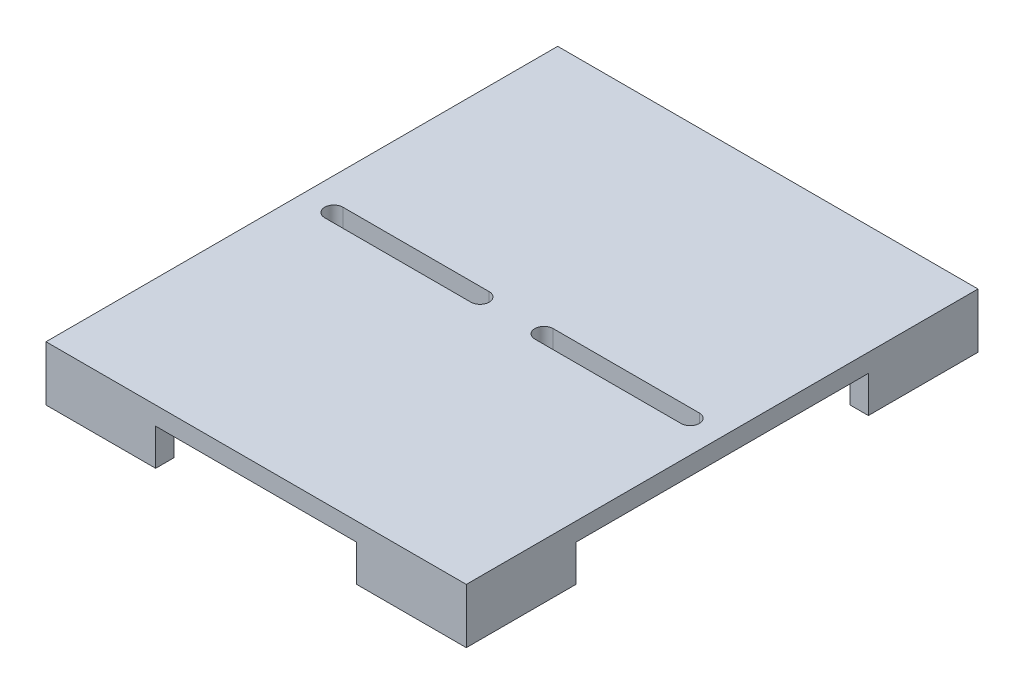
ISO-10303-21;
HEADER;
FILE_DESCRIPTION(('STEP AP214'),'2;1');
FILE_NAME('part.step','',(''),(''),'','','');
FILE_SCHEMA(('AUTOMOTIVE_DESIGN { 1 0 10303 214 1 1 1 1 }'));
ENDSEC;
DATA;
#1=APPLICATION_CONTEXT('core data for automotive mechanical design processes');
#2=APPLICATION_PROTOCOL_DEFINITION('international standard','automotive_design',2000,#1);
#3=PRODUCT_CONTEXT('',#1,'mechanical');
#4=PRODUCT('Part','Part','',(#3));
#5=PRODUCT_RELATED_PRODUCT_CATEGORY('part','',(#4));
#6=PRODUCT_DEFINITION_FORMATION('','',#4);
#7=PRODUCT_DEFINITION_CONTEXT('part definition',#1,'design');
#8=PRODUCT_DEFINITION('design','',#6,#7);
#9=PRODUCT_DEFINITION_SHAPE('','',#8);
#10=(LENGTH_UNIT() NAMED_UNIT(*) SI_UNIT(.MILLI.,.METRE.));
#11=(NAMED_UNIT(*) PLANE_ANGLE_UNIT() SI_UNIT($,.RADIAN.));
#12=(NAMED_UNIT(*) SI_UNIT($,.STERADIAN.) SOLID_ANGLE_UNIT());
#13=UNCERTAINTY_MEASURE_WITH_UNIT(LENGTH_MEASURE(1.E-05),#10,'distance_accuracy_value','');
#14=(GEOMETRIC_REPRESENTATION_CONTEXT(3) GLOBAL_UNCERTAINTY_ASSIGNED_CONTEXT((#13)) GLOBAL_UNIT_ASSIGNED_CONTEXT((#10,
#11,#12)) REPRESENTATION_CONTEXT('',''));
#15=CARTESIAN_POINT('',(0.,0.,0.));
#16=DIRECTION('',(0.,0.,1.));
#17=DIRECTION('',(1.,0.,0.));
#18=AXIS2_PLACEMENT_3D('',#15,#16,#17);
#19=CARTESIAN_POINT('',(0.,0.,0.));
#20=DIRECTION('',(0.,1.,0.));
#21=DIRECTION('',(0.,0.,1.));
#22=AXIS2_PLACEMENT_3D('',#19,#20,#21);
#23=PLANE('',#22);
#24=DIRECTION('',(1.,0.,0.));
#25=VECTOR('',#24,1.);
#26=CARTESIAN_POINT('',(123.825,0.,6.35));
#27=LINE('',#26,#25);
#28=CARTESIAN_POINT('',(22.225,0.,6.35));
#29=VERTEX_POINT('',#28);
#30=CARTESIAN_POINT('',(123.825,0.,6.35));
#31=VERTEX_POINT('',#30);
#32=EDGE_CURVE('E416',#29,#31,#27,.T.);
#33=ORIENTED_EDGE('',*,*,#32,.T.);
#34=CARTESIAN_POINT('',(123.825,0.,0.));
#35=DIRECTION('',(0.,1.,0.));
#36=DIRECTION('',(0.,0.,-1.));
#37=AXIS2_PLACEMENT_3D('',#34,#35,#36);
#38=CIRCLE('',#37,6.35);
#39=CARTESIAN_POINT('',(123.825,0.,-6.35));
#40=VERTEX_POINT('',#39);
#41=EDGE_CURVE('E406',#31,#40,#38,.T.);
#42=ORIENTED_EDGE('',*,*,#41,.T.);
#43=DIRECTION('',(-1.,0.,0.));
#44=VECTOR('',#43,1.);
#45=CARTESIAN_POINT('',(123.825,0.,-6.35));
#46=LINE('',#45,#44);
#47=CARTESIAN_POINT('',(22.225,0.,-6.35));
#48=VERTEX_POINT('',#47);
#49=EDGE_CURVE('E409',#40,#48,#46,.T.);
#50=ORIENTED_EDGE('',*,*,#49,.T.);
#51=CARTESIAN_POINT('',(22.225,0.,0.));
#52=DIRECTION('',(0.,1.,0.));
#53=DIRECTION('',(0.,0.,-1.));
#54=AXIS2_PLACEMENT_3D('',#51,#52,#53);
#55=CIRCLE('',#54,6.35);
#56=EDGE_CURVE('E413',#48,#29,#55,.T.);
#57=ORIENTED_EDGE('',*,*,#56,.T.);
#58=EDGE_LOOP('',(#33,#42,#50,#57));
#59=FACE_BOUND('',#58,.T.);
#60=DIRECTION('',(-1.,0.,0.));
#61=VECTOR('',#60,1.);
#62=CARTESIAN_POINT('',(-123.825,0.,-6.35));
#63=LINE('',#62,#61);
#64=CARTESIAN_POINT('',(-22.225,0.,-6.35));
#65=VERTEX_POINT('',#64);
#66=CARTESIAN_POINT('',(-123.825,0.,-6.35));
#67=VERTEX_POINT('',#66);
#68=EDGE_CURVE('E448',#65,#67,#63,.T.);
#69=ORIENTED_EDGE('',*,*,#68,.T.);
#70=CARTESIAN_POINT('',(-123.825,0.,0.));
#71=DIRECTION('',(0.,1.,0.));
#72=DIRECTION('',(0.,0.,1.));
#73=AXIS2_PLACEMENT_3D('',#70,#71,#72);
#74=CIRCLE('',#73,6.35);
#75=CARTESIAN_POINT('',(-123.825,0.,6.35));
#76=VERTEX_POINT('',#75);
#77=EDGE_CURVE('E438',#67,#76,#74,.T.);
#78=ORIENTED_EDGE('',*,*,#77,.T.);
#79=DIRECTION('',(1.,0.,0.));
#80=VECTOR('',#79,1.);
#81=CARTESIAN_POINT('',(-123.825,0.,6.35));
#82=LINE('',#81,#80);
#83=CARTESIAN_POINT('',(-22.225,0.,6.35));
#84=VERTEX_POINT('',#83);
#85=EDGE_CURVE('E441',#76,#84,#82,.T.);
#86=ORIENTED_EDGE('',*,*,#85,.T.);
#87=CARTESIAN_POINT('',(-22.225,0.,0.));
#88=DIRECTION('',(0.,1.,0.));
#89=DIRECTION('',(0.,0.,1.));
#90=AXIS2_PLACEMENT_3D('',#87,#88,#89);
#91=CIRCLE('',#90,6.35);
#92=EDGE_CURVE('E445',#84,#65,#91,.T.);
#93=ORIENTED_EDGE('',*,*,#92,.T.);
#94=EDGE_LOOP('',(#69,#78,#86,#93));
#95=FACE_BOUND('',#94,.T.);
#96=DIRECTION('',(0.,0.,1.));
#97=VECTOR('',#96,1.);
#98=CARTESIAN_POINT('',(-69.85,0.,0.));
#99=LINE('',#98,#97);
#100=CARTESIAN_POINT('',(-69.85,0.,-177.8));
#101=VERTEX_POINT('',#100);
#102=CARTESIAN_POINT('',(-69.85,0.,-165.1));
#103=VERTEX_POINT('',#102);
#104=EDGE_CURVE('E814',#101,#103,#99,.T.);
#105=ORIENTED_EDGE('',*,*,#104,.F.);
#106=DIRECTION('',(1.,0.,0.));
#107=VECTOR('',#106,1.);
#108=CARTESIAN_POINT('',(0.,0.,-177.8));
#109=LINE('',#108,#107);
#110=CARTESIAN_POINT('',(69.85,0.,-177.8));
#111=VERTEX_POINT('',#110);
#112=EDGE_CURVE('E268',#101,#111,#109,.T.);
#113=ORIENTED_EDGE('',*,*,#112,.T.);
#114=DIRECTION('',(0.,0.,1.));
#115=VECTOR('',#114,1.);
#116=CARTESIAN_POINT('',(69.85,0.,0.));
#117=LINE('',#116,#115);
#118=CARTESIAN_POINT('',(69.85,0.,-165.1));
#119=VERTEX_POINT('',#118);
#120=EDGE_CURVE('E269',#111,#119,#117,.T.);
#121=ORIENTED_EDGE('',*,*,#120,.T.);
#122=DIRECTION('',(1.,0.,0.));
#123=VECTOR('',#122,1.);
#124=CARTESIAN_POINT('',(0.,0.,-165.1));
#125=LINE('',#124,#123);
#126=CARTESIAN_POINT('',(133.35,0.,-165.1));
#127=VERTEX_POINT('',#126);
#128=EDGE_CURVE('E281',#119,#127,#125,.T.);
#129=ORIENTED_EDGE('',*,*,#128,.T.);
#130=DIRECTION('',(0.,0.,-1.));
#131=VECTOR('',#130,1.);
#132=CARTESIAN_POINT('',(133.35,0.,0.));
#133=LINE('',#132,#131);
#134=CARTESIAN_POINT('',(133.35,0.,-101.6));
#135=VERTEX_POINT('',#134);
#136=EDGE_CURVE('E296',#135,#127,#133,.T.);
#137=ORIENTED_EDGE('',*,*,#136,.F.);
#138=DIRECTION('',(1.,0.,0.));
#139=VECTOR('',#138,1.);
#140=CARTESIAN_POINT('',(0.,0.,-101.6));
#141=LINE('',#140,#139);
#142=CARTESIAN_POINT('',(146.05,0.,-101.6));
#143=VERTEX_POINT('',#142);
#144=EDGE_CURVE('E271',#135,#143,#141,.T.);
#145=ORIENTED_EDGE('',*,*,#144,.T.);
#146=DIRECTION('',(0.,0.,-1.));
#147=VECTOR('',#146,1.);
#148=CARTESIAN_POINT('',(146.05,0.,0.));
#149=LINE('',#148,#147);
#150=CARTESIAN_POINT('',(146.05,0.,101.6));
#151=VERTEX_POINT('',#150);
#152=EDGE_CURVE('E489',#151,#143,#149,.T.);
#153=ORIENTED_EDGE('',*,*,#152,.F.);
#154=DIRECTION('',(1.,0.,0.));
#155=VECTOR('',#154,1.);
#156=CARTESIAN_POINT('',(0.,0.,101.6));
#157=LINE('',#156,#155);
#158=CARTESIAN_POINT('',(133.35,0.,101.6));
#159=VERTEX_POINT('',#158);
#160=EDGE_CURVE('E318',#159,#151,#157,.T.);
#161=ORIENTED_EDGE('',*,*,#160,.F.);
#162=DIRECTION('',(0.,0.,-1.));
#163=VECTOR('',#162,1.);
#164=CARTESIAN_POINT('',(133.35,0.,0.));
#165=LINE('',#164,#163);
#166=CARTESIAN_POINT('',(133.35,0.,165.1));
#167=VERTEX_POINT('',#166);
#168=EDGE_CURVE('E334',#167,#159,#165,.T.);
#169=ORIENTED_EDGE('',*,*,#168,.F.);
#170=DIRECTION('',(1.,0.,0.));
#171=VECTOR('',#170,1.);
#172=CARTESIAN_POINT('',(0.,0.,165.1));
#173=LINE('',#172,#171);
#174=CARTESIAN_POINT('',(69.85,0.,165.1));
#175=VERTEX_POINT('',#174);
#176=EDGE_CURVE('E332',#175,#167,#173,.T.);
#177=ORIENTED_EDGE('',*,*,#176,.F.);
#178=DIRECTION('',(0.,0.,1.));
#179=VECTOR('',#178,1.);
#180=CARTESIAN_POINT('',(69.85,0.,0.));
#181=LINE('',#180,#179);
#182=CARTESIAN_POINT('',(69.85,0.,177.8));
#183=VERTEX_POINT('',#182);
#184=EDGE_CURVE('E313',#175,#183,#181,.T.);
#185=ORIENTED_EDGE('',*,*,#184,.T.);
#186=DIRECTION('',(1.,0.,0.));
#187=VECTOR('',#186,1.);
#188=CARTESIAN_POINT('',(0.,0.,177.8));
#189=LINE('',#188,#187);
#190=CARTESIAN_POINT('',(-69.85,0.,177.8));
#191=VERTEX_POINT('',#190);
#192=EDGE_CURVE('E378',#191,#183,#189,.T.);
#193=ORIENTED_EDGE('',*,*,#192,.F.);
#194=DIRECTION('',(0.,0.,1.));
#195=VECTOR('',#194,1.);
#196=CARTESIAN_POINT('',(-69.85,0.,0.));
#197=LINE('',#196,#195);
#198=CARTESIAN_POINT('',(-69.85,0.,165.1));
#199=VERTEX_POINT('',#198);
#200=EDGE_CURVE('E369',#199,#191,#197,.T.);
#201=ORIENTED_EDGE('',*,*,#200,.F.);
#202=DIRECTION('',(1.,0.,0.));
#203=VECTOR('',#202,1.);
#204=CARTESIAN_POINT('',(0.,0.,165.1));
#205=LINE('',#204,#203);
#206=CARTESIAN_POINT('',(-133.35,0.,165.1));
#207=VERTEX_POINT('',#206);
#208=EDGE_CURVE('E349',#207,#199,#205,.T.);
#209=ORIENTED_EDGE('',*,*,#208,.F.);
#210=DIRECTION('',(0.,0.,-1.));
#211=VECTOR('',#210,1.);
#212=CARTESIAN_POINT('',(-133.35,0.,0.));
#213=LINE('',#212,#211);
#214=CARTESIAN_POINT('',(-133.35,0.,101.6));
#215=VERTEX_POINT('',#214);
#216=EDGE_CURVE('E354',#207,#215,#213,.T.);
#217=ORIENTED_EDGE('',*,*,#216,.T.);
#218=DIRECTION('',(1.,0.,0.));
#219=VECTOR('',#218,1.);
#220=CARTESIAN_POINT('',(0.,0.,101.6));
#221=LINE('',#220,#219);
#222=CARTESIAN_POINT('',(-146.05,0.,101.6));
#223=VERTEX_POINT('',#222);
#224=EDGE_CURVE('E377',#223,#215,#221,.T.);
#225=ORIENTED_EDGE('',*,*,#224,.F.);
#226=DIRECTION('',(0.,0.,-1.));
#227=VECTOR('',#226,1.);
#228=CARTESIAN_POINT('',(-146.05,0.,0.));
#229=LINE('',#228,#227);
#230=CARTESIAN_POINT('',(-146.05,0.,-101.6));
#231=VERTEX_POINT('',#230);
#232=EDGE_CURVE('E463',#223,#231,#229,.T.);
#233=ORIENTED_EDGE('',*,*,#232,.T.);
#234=DIRECTION('',(1.,0.,0.));
#235=VECTOR('',#234,1.);
#236=CARTESIAN_POINT('',(0.,0.,-101.6));
#237=LINE('',#236,#235);
#238=CARTESIAN_POINT('',(-133.35,0.,-101.6));
#239=VERTEX_POINT('',#238);
#240=EDGE_CURVE('E264',#231,#239,#237,.T.);
#241=ORIENTED_EDGE('',*,*,#240,.T.);
#242=DIRECTION('',(0.,0.,-1.));
#243=VECTOR('',#242,1.);
#244=CARTESIAN_POINT('',(-133.35,0.,0.));
#245=LINE('',#244,#243);
#246=CARTESIAN_POINT('',(-133.35,0.,-165.1));
#247=VERTEX_POINT('',#246);
#248=EDGE_CURVE('E56',#239,#247,#245,.T.);
#249=ORIENTED_EDGE('',*,*,#248,.T.);
#250=DIRECTION('',(1.,0.,0.));
#251=VECTOR('',#250,1.);
#252=CARTESIAN_POINT('',(0.,0.,-165.1));
#253=LINE('',#252,#251);
#254=EDGE_CURVE('E51',#247,#103,#253,.T.);
#255=ORIENTED_EDGE('',*,*,#254,.T.);
#256=EDGE_LOOP('',(#105,#113,#121,#129,#137,#145,#153,#161,#169,#177,#185,#193,#201,#209,#217,
#225,#233,#241,#249,#255));
#257=FACE_BOUND('',#256,.T.);
#258=ADVANCED_FACE('F34',(#59,#95,#257),#23,.F.);
#259=CARTESIAN_POINT('',(-146.05,12.7,0.));
#260=DIRECTION('',(-1.,0.,0.));
#261=DIRECTION('',(0.,0.,1.));
#262=AXIS2_PLACEMENT_3D('',#259,#260,#261);
#263=PLANE('',#262);
#264=ORIENTED_EDGE('',*,*,#232,.F.);
#265=DIRECTION('',(0.,1.,0.));
#266=VECTOR('',#265,1.);
#267=CARTESIAN_POINT('',(-146.05,-25.4,101.6));
#268=LINE('',#267,#266);
#269=CARTESIAN_POINT('',(-146.05,-25.4,101.6));
#270=VERTEX_POINT('',#269);
#271=EDGE_CURVE('E385',#270,#223,#268,.T.);
#272=ORIENTED_EDGE('',*,*,#271,.F.);
#273=DIRECTION('',(0.,0.,-1.));
#274=VECTOR('',#273,1.);
#275=CARTESIAN_POINT('',(-146.05,-25.4,0.));
#276=LINE('',#275,#274);
#277=CARTESIAN_POINT('',(-146.05,-25.4,177.8));
#278=VERTEX_POINT('',#277);
#279=EDGE_CURVE('E359',#278,#270,#276,.T.);
#280=ORIENTED_EDGE('',*,*,#279,.F.);
#281=DIRECTION('',(0.,-1.,0.));
#282=VECTOR('',#281,1.);
#283=CARTESIAN_POINT('',(-146.05,12.7,177.8));
#284=LINE('',#283,#282);
#285=CARTESIAN_POINT('',(-146.05,12.7,177.8));
#286=VERTEX_POINT('',#285);
#287=EDGE_CURVE('E11',#286,#278,#284,.T.);
#288=ORIENTED_EDGE('',*,*,#287,.F.);
#289=DIRECTION('',(0.,0.,-1.));
#290=VECTOR('',#289,1.);
#291=CARTESIAN_POINT('',(-146.05,12.7,0.));
#292=LINE('',#291,#290);
#293=CARTESIAN_POINT('',(-146.05,12.7,-177.8));
#294=VERTEX_POINT('',#293);
#295=EDGE_CURVE('E470',#286,#294,#292,.T.);
#296=ORIENTED_EDGE('',*,*,#295,.T.);
#297=DIRECTION('',(0.,-1.,0.));
#298=VECTOR('',#297,1.);
#299=CARTESIAN_POINT('',(-146.05,12.7,-177.8));
#300=LINE('',#299,#298);
#301=CARTESIAN_POINT('',(-146.05,-25.4,-177.8));
#302=VERTEX_POINT('',#301);
#303=EDGE_CURVE('E480',#294,#302,#300,.T.);
#304=ORIENTED_EDGE('',*,*,#303,.T.);
#305=DIRECTION('',(0.,0.,-1.));
#306=VECTOR('',#305,1.);
#307=CARTESIAN_POINT('',(-146.05,-25.4,0.));
#308=LINE('',#307,#306);
#309=CARTESIAN_POINT('',(-146.05,-25.4,-101.6));
#310=VERTEX_POINT('',#309);
#311=EDGE_CURVE('E262',#310,#302,#308,.T.);
#312=ORIENTED_EDGE('',*,*,#311,.F.);
#313=DIRECTION('',(0.,1.,0.));
#314=VECTOR('',#313,1.);
#315=CARTESIAN_POINT('',(-146.05,-25.4,-101.6));
#316=LINE('',#315,#314);
#317=EDGE_CURVE('E804',#310,#231,#316,.T.);
#318=ORIENTED_EDGE('',*,*,#317,.T.);
#319=EDGE_LOOP('',(#264,#272,#280,#288,#296,#304,#312,#318));
#320=FACE_BOUND('',#319,.T.);
#321=ADVANCED_FACE('F36',(#320),#263,.T.);
#322=CARTESIAN_POINT('',(0.,12.7,177.8));
#323=DIRECTION('',(0.,0.,-1.));
#324=DIRECTION('',(-1.,0.,0.));
#325=AXIS2_PLACEMENT_3D('',#322,#323,#324);
#326=PLANE('',#325);
#327=ORIENTED_EDGE('',*,*,#287,.T.);
#328=DIRECTION('',(-1.,0.,0.));
#329=VECTOR('',#328,1.);
#330=CARTESIAN_POINT('',(0.,-25.4,177.8));
#331=LINE('',#330,#329);
#332=CARTESIAN_POINT('',(-69.85,-25.4,177.8));
#333=VERTEX_POINT('',#332);
#334=EDGE_CURVE('E356',#333,#278,#331,.T.);
#335=ORIENTED_EDGE('',*,*,#334,.F.);
#336=DIRECTION('',(0.,1.,0.));
#337=VECTOR('',#336,1.);
#338=CARTESIAN_POINT('',(-69.85,-25.4,177.8));
#339=LINE('',#338,#337);
#340=EDGE_CURVE('E381',#333,#191,#339,.T.);
#341=ORIENTED_EDGE('',*,*,#340,.T.);
#342=ORIENTED_EDGE('',*,*,#192,.T.);
#343=DIRECTION('',(0.,1.,0.));
#344=VECTOR('',#343,1.);
#345=CARTESIAN_POINT('',(69.85,-25.4,177.8));
#346=LINE('',#345,#344);
#347=CARTESIAN_POINT('',(69.85,-25.4,177.8));
#348=VERTEX_POINT('',#347);
#349=EDGE_CURVE('E329',#348,#183,#346,.T.);
#350=ORIENTED_EDGE('',*,*,#349,.F.);
#351=DIRECTION('',(-1.,0.,0.));
#352=VECTOR('',#351,1.);
#353=CARTESIAN_POINT('',(0.,-25.4,177.8));
#354=LINE('',#353,#352);
#355=CARTESIAN_POINT('',(146.05,-25.4,177.8));
#356=VERTEX_POINT('',#355);
#357=EDGE_CURVE('E327',#356,#348,#354,.T.);
#358=ORIENTED_EDGE('',*,*,#357,.F.);
#359=DIRECTION('',(0.,-1.,0.));
#360=VECTOR('',#359,1.);
#361=CARTESIAN_POINT('',(146.05,12.7,177.8));
#362=LINE('',#361,#360);
#363=CARTESIAN_POINT('',(146.05,12.7,177.8));
#364=VERTEX_POINT('',#363);
#365=EDGE_CURVE('E43',#364,#356,#362,.T.);
#366=ORIENTED_EDGE('',*,*,#365,.F.);
#367=DIRECTION('',(1.,0.,0.));
#368=VECTOR('',#367,1.);
#369=CARTESIAN_POINT('',(0.,12.7,177.8));
#370=LINE('',#369,#368);
#371=EDGE_CURVE('E473',#286,#364,#370,.T.);
#372=ORIENTED_EDGE('',*,*,#371,.F.);
#373=EDGE_LOOP('',(#327,#335,#341,#342,#350,#358,#366,#372));
#374=FACE_BOUND('',#373,.T.);
#375=ADVANCED_FACE('F497',(#374),#326,.F.);
#376=CARTESIAN_POINT('',(146.05,12.7,0.));
#377=DIRECTION('',(-1.,0.,0.));
#378=DIRECTION('',(0.,0.,1.));
#379=AXIS2_PLACEMENT_3D('',#376,#377,#378);
#380=PLANE('',#379);
#381=ORIENTED_EDGE('',*,*,#365,.T.);
#382=DIRECTION('',(0.,0.,1.));
#383=VECTOR('',#382,1.);
#384=CARTESIAN_POINT('',(146.05,-25.4,0.));
#385=LINE('',#384,#383);
#386=CARTESIAN_POINT('',(146.05,-25.4,101.6));
#387=VERTEX_POINT('',#386);
#388=EDGE_CURVE('E324',#387,#356,#385,.T.);
#389=ORIENTED_EDGE('',*,*,#388,.F.);
#390=DIRECTION('',(0.,1.,0.));
#391=VECTOR('',#390,1.);
#392=CARTESIAN_POINT('',(146.05,-25.4,101.6));
#393=LINE('',#392,#391);
#394=EDGE_CURVE('E339',#387,#151,#393,.T.);
#395=ORIENTED_EDGE('',*,*,#394,.T.);
#396=ORIENTED_EDGE('',*,*,#152,.T.);
#397=DIRECTION('',(0.,1.,0.));
#398=VECTOR('',#397,1.);
#399=CARTESIAN_POINT('',(146.05,-25.4,-101.6));
#400=LINE('',#399,#398);
#401=CARTESIAN_POINT('',(146.05,-25.4,-101.6));
#402=VERTEX_POINT('',#401);
#403=EDGE_CURVE('E308',#402,#143,#400,.T.);
#404=ORIENTED_EDGE('',*,*,#403,.F.);
#405=DIRECTION('',(0.,0.,1.));
#406=VECTOR('',#405,1.);
#407=CARTESIAN_POINT('',(146.05,-25.4,0.));
#408=LINE('',#407,#406);
#409=CARTESIAN_POINT('',(146.05,-25.4,-177.8));
#410=VERTEX_POINT('',#409);
#411=EDGE_CURVE('E284',#410,#402,#408,.T.);
#412=ORIENTED_EDGE('',*,*,#411,.F.);
#413=DIRECTION('',(0.,-1.,0.));
#414=VECTOR('',#413,1.);
#415=CARTESIAN_POINT('',(146.05,12.7,-177.8));
#416=LINE('',#415,#414);
#417=CARTESIAN_POINT('',(146.05,12.7,-177.8));
#418=VERTEX_POINT('',#417);
#419=EDGE_CURVE('E486',#418,#410,#416,.T.);
#420=ORIENTED_EDGE('',*,*,#419,.F.);
#421=DIRECTION('',(0.,0.,-1.));
#422=VECTOR('',#421,1.);
#423=CARTESIAN_POINT('',(146.05,12.7,0.));
#424=LINE('',#423,#422);
#425=EDGE_CURVE('E475',#364,#418,#424,.T.);
#426=ORIENTED_EDGE('',*,*,#425,.F.);
#427=EDGE_LOOP('',(#381,#389,#395,#396,#404,#412,#420,#426));
#428=FACE_BOUND('',#427,.T.);
#429=ADVANCED_FACE('F538',(#428),#380,.F.);
#430=CARTESIAN_POINT('',(0.,12.7,-177.8));
#431=DIRECTION('',(0.,0.,-1.));
#432=DIRECTION('',(-1.,0.,0.));
#433=AXIS2_PLACEMENT_3D('',#430,#431,#432);
#434=PLANE('',#433);
#435=ORIENTED_EDGE('',*,*,#112,.F.);
#436=DIRECTION('',(0.,1.,0.));
#437=VECTOR('',#436,1.);
#438=CARTESIAN_POINT('',(-69.85,-25.4,-177.8));
#439=LINE('',#438,#437);
#440=CARTESIAN_POINT('',(-69.85,-25.4,-177.8));
#441=VERTEX_POINT('',#440);
#442=EDGE_CURVE('E249',#441,#101,#439,.T.);
#443=ORIENTED_EDGE('',*,*,#442,.F.);
#444=DIRECTION('',(1.,0.,0.));
#445=VECTOR('',#444,1.);
#446=CARTESIAN_POINT('',(0.,-25.4,-177.8));
#447=LINE('',#446,#445);
#448=EDGE_CURVE('E255',#302,#441,#447,.T.);
#449=ORIENTED_EDGE('',*,*,#448,.F.);
#450=ORIENTED_EDGE('',*,*,#303,.F.);
#451=DIRECTION('',(1.,0.,0.));
#452=VECTOR('',#451,1.);
#453=CARTESIAN_POINT('',(0.,12.7,-177.8));
#454=LINE('',#453,#452);
#455=EDGE_CURVE('E477',#294,#418,#454,.T.);
#456=ORIENTED_EDGE('',*,*,#455,.T.);
#457=ORIENTED_EDGE('',*,*,#419,.T.);
#458=DIRECTION('',(1.,0.,0.));
#459=VECTOR('',#458,1.);
#460=CARTESIAN_POINT('',(0.,-25.4,-177.8));
#461=LINE('',#460,#459);
#462=CARTESIAN_POINT('',(69.85,-25.4,-177.8));
#463=VERTEX_POINT('',#462);
#464=EDGE_CURVE('E280',#463,#410,#461,.T.);
#465=ORIENTED_EDGE('',*,*,#464,.F.);
#466=DIRECTION('',(0.,1.,0.));
#467=VECTOR('',#466,1.);
#468=CARTESIAN_POINT('',(69.85,-25.4,-177.8));
#469=LINE('',#468,#467);
#470=EDGE_CURVE('E311',#463,#111,#469,.T.);
#471=ORIENTED_EDGE('',*,*,#470,.T.);
#472=EDGE_LOOP('',(#435,#443,#449,#450,#456,#457,#465,#471));
#473=FACE_BOUND('',#472,.T.);
#474=ADVANCED_FACE('F266',(#473),#434,.T.);
#475=CARTESIAN_POINT('',(0.,12.7,0.));
#476=DIRECTION('',(0.,1.,0.));
#477=DIRECTION('',(0.,0.,1.));
#478=AXIS2_PLACEMENT_3D('',#475,#476,#477);
#479=PLANE('',#478);
#480=CARTESIAN_POINT('',(123.825,12.7,0.));
#481=DIRECTION('',(0.,1.,0.));
#482=DIRECTION('',(0.,0.,-1.));
#483=AXIS2_PLACEMENT_3D('',#480,#481,#482);
#484=CIRCLE('',#483,6.35);
#485=CARTESIAN_POINT('',(123.825,12.7,6.35));
#486=VERTEX_POINT('',#485);
#487=CARTESIAN_POINT('',(123.825,12.7,-6.35));
#488=VERTEX_POINT('',#487);
#489=EDGE_CURVE('E405',#486,#488,#484,.T.);
#490=ORIENTED_EDGE('',*,*,#489,.F.);
#491=DIRECTION('',(1.,0.,0.));
#492=VECTOR('',#491,1.);
#493=CARTESIAN_POINT('',(123.825,12.7,6.35));
#494=LINE('',#493,#492);
#495=CARTESIAN_POINT('',(22.225,12.7,6.35));
#496=VERTEX_POINT('',#495);
#497=EDGE_CURVE('E410',#496,#486,#494,.T.);
#498=ORIENTED_EDGE('',*,*,#497,.F.);
#499=CARTESIAN_POINT('',(22.225,12.7,0.));
#500=DIRECTION('',(0.,1.,0.));
#501=DIRECTION('',(0.,0.,-1.));
#502=AXIS2_PLACEMENT_3D('',#499,#500,#501);
#503=CIRCLE('',#502,6.35);
#504=CARTESIAN_POINT('',(22.225,12.7,-6.35));
#505=VERTEX_POINT('',#504);
#506=EDGE_CURVE('E424',#505,#496,#503,.T.);
#507=ORIENTED_EDGE('',*,*,#506,.F.);
#508=DIRECTION('',(-1.,0.,0.));
#509=VECTOR('',#508,1.);
#510=CARTESIAN_POINT('',(123.825,12.7,-6.35));
#511=LINE('',#510,#509);
#512=EDGE_CURVE('E421',#488,#505,#511,.T.);
#513=ORIENTED_EDGE('',*,*,#512,.F.);
#514=EDGE_LOOP('',(#490,#498,#507,#513));
#515=FACE_BOUND('',#514,.T.);
#516=CARTESIAN_POINT('',(-123.825,12.7,0.));
#517=DIRECTION('',(0.,1.,0.));
#518=DIRECTION('',(0.,0.,1.));
#519=AXIS2_PLACEMENT_3D('',#516,#517,#518);
#520=CIRCLE('',#519,6.35);
#521=CARTESIAN_POINT('',(-123.825,12.7,-6.35));
#522=VERTEX_POINT('',#521);
#523=CARTESIAN_POINT('',(-123.825,12.7,6.35));
#524=VERTEX_POINT('',#523);
#525=EDGE_CURVE('E431',#522,#524,#520,.T.);
#526=ORIENTED_EDGE('',*,*,#525,.F.);
#527=DIRECTION('',(-1.,0.,0.));
#528=VECTOR('',#527,1.);
#529=CARTESIAN_POINT('',(-123.825,12.7,-6.35));
#530=LINE('',#529,#528);
#531=CARTESIAN_POINT('',(-22.225,12.7,-6.35));
#532=VERTEX_POINT('',#531);
#533=EDGE_CURVE('E442',#532,#522,#530,.T.);
#534=ORIENTED_EDGE('',*,*,#533,.F.);
#535=CARTESIAN_POINT('',(-22.225,12.7,0.));
#536=DIRECTION('',(0.,1.,0.));
#537=DIRECTION('',(0.,0.,1.));
#538=AXIS2_PLACEMENT_3D('',#535,#536,#537);
#539=CIRCLE('',#538,6.35);
#540=CARTESIAN_POINT('',(-22.225,12.7,6.35));
#541=VERTEX_POINT('',#540);
#542=EDGE_CURVE('E456',#541,#532,#539,.T.);
#543=ORIENTED_EDGE('',*,*,#542,.F.);
#544=DIRECTION('',(1.,0.,0.));
#545=VECTOR('',#544,1.);
#546=CARTESIAN_POINT('',(-123.825,12.7,6.35));
#547=LINE('',#546,#545);
#548=EDGE_CURVE('E453',#524,#541,#547,.T.);
#549=ORIENTED_EDGE('',*,*,#548,.F.);
#550=EDGE_LOOP('',(#526,#534,#543,#549));
#551=FACE_BOUND('',#550,.T.);
#552=ORIENTED_EDGE('',*,*,#295,.F.);
#553=ORIENTED_EDGE('',*,*,#371,.T.);
#554=ORIENTED_EDGE('',*,*,#425,.T.);
#555=ORIENTED_EDGE('',*,*,#455,.F.);
#556=EDGE_LOOP('',(#552,#553,#554,#555));
#557=FACE_BOUND('',#556,.T.);
#558=ADVANCED_FACE('F534',(#515,#551,#557),#479,.T.);
#559=CARTESIAN_POINT('',(-123.825,0.,0.));
#560=DIRECTION('',(0.,1.,0.));
#561=DIRECTION('',(0.,0.,1.));
#562=AXIS2_PLACEMENT_3D('',#559,#560,#561);
#563=CYLINDRICAL_SURFACE('',#562,6.35);
#564=ORIENTED_EDGE('',*,*,#525,.T.);
#565=DIRECTION('',(0.,1.,0.));
#566=VECTOR('',#565,1.);
#567=CARTESIAN_POINT('',(-123.825,0.,6.35));
#568=LINE('',#567,#566);
#569=EDGE_CURVE('E451',#76,#524,#568,.T.);
#570=ORIENTED_EDGE('',*,*,#569,.F.);
#571=ORIENTED_EDGE('',*,*,#77,.F.);
#572=DIRECTION('',(0.,1.,0.));
#573=VECTOR('',#572,1.);
#574=CARTESIAN_POINT('',(-123.825,0.,-6.35));
#575=LINE('',#574,#573);
#576=EDGE_CURVE('E461',#67,#522,#575,.T.);
#577=ORIENTED_EDGE('',*,*,#576,.T.);
#578=EDGE_LOOP('',(#564,#570,#571,#577));
#579=FACE_BOUND('',#578,.T.);
#580=ADVANCED_FACE('F560',(#579),#563,.F.);
#581=CARTESIAN_POINT('',(-123.825,0.,-6.35));
#582=DIRECTION('',(0.,0.,-1.));
#583=DIRECTION('',(-1.,0.,0.));
#584=AXIS2_PLACEMENT_3D('',#581,#582,#583);
#585=PLANE('',#584);
#586=ORIENTED_EDGE('',*,*,#533,.T.);
#587=ORIENTED_EDGE('',*,*,#576,.F.);
#588=ORIENTED_EDGE('',*,*,#68,.F.);
#589=DIRECTION('',(0.,1.,0.));
#590=VECTOR('',#589,1.);
#591=CARTESIAN_POINT('',(-22.225,0.,-6.35));
#592=LINE('',#591,#590);
#593=EDGE_CURVE('E464',#65,#532,#592,.T.);
#594=ORIENTED_EDGE('',*,*,#593,.T.);
#595=EDGE_LOOP('',(#586,#587,#588,#594));
#596=FACE_BOUND('',#595,.T.);
#597=ADVANCED_FACE('F567',(#596),#585,.F.);
#598=CARTESIAN_POINT('',(-22.225,0.,0.));
#599=DIRECTION('',(0.,1.,0.));
#600=DIRECTION('',(0.,0.,1.));
#601=AXIS2_PLACEMENT_3D('',#598,#599,#600);
#602=CYLINDRICAL_SURFACE('',#601,6.35);
#603=ORIENTED_EDGE('',*,*,#542,.T.);
#604=ORIENTED_EDGE('',*,*,#593,.F.);
#605=ORIENTED_EDGE('',*,*,#92,.F.);
#606=DIRECTION('',(0.,1.,0.));
#607=VECTOR('',#606,1.);
#608=CARTESIAN_POINT('',(-22.225,0.,6.35));
#609=LINE('',#608,#607);
#610=EDGE_CURVE('E466',#84,#541,#609,.T.);
#611=ORIENTED_EDGE('',*,*,#610,.T.);
#612=EDGE_LOOP('',(#603,#604,#605,#611));
#613=FACE_BOUND('',#612,.T.);
#614=ADVANCED_FACE('F574',(#613),#602,.F.);
#615=CARTESIAN_POINT('',(-123.825,0.,6.35));
#616=DIRECTION('',(0.,0.,1.));
#617=DIRECTION('',(1.,0.,0.));
#618=AXIS2_PLACEMENT_3D('',#615,#616,#617);
#619=PLANE('',#618);
#620=ORIENTED_EDGE('',*,*,#548,.T.);
#621=ORIENTED_EDGE('',*,*,#610,.F.);
#622=ORIENTED_EDGE('',*,*,#85,.F.);
#623=ORIENTED_EDGE('',*,*,#569,.T.);
#624=EDGE_LOOP('',(#620,#621,#622,#623));
#625=FACE_BOUND('',#624,.T.);
#626=ADVANCED_FACE('F582',(#625),#619,.F.);
#627=CARTESIAN_POINT('',(123.825,0.,0.));
#628=DIRECTION('',(0.,1.,0.));
#629=DIRECTION('',(0.,0.,1.));
#630=AXIS2_PLACEMENT_3D('',#627,#628,#629);
#631=CYLINDRICAL_SURFACE('',#630,6.35);
#632=ORIENTED_EDGE('',*,*,#489,.T.);
#633=DIRECTION('',(0.,1.,0.));
#634=VECTOR('',#633,1.);
#635=CARTESIAN_POINT('',(123.825,0.,-6.35));
#636=LINE('',#635,#634);
#637=EDGE_CURVE('E419',#40,#488,#636,.T.);
#638=ORIENTED_EDGE('',*,*,#637,.F.);
#639=ORIENTED_EDGE('',*,*,#41,.F.);
#640=DIRECTION('',(0.,1.,0.));
#641=VECTOR('',#640,1.);
#642=CARTESIAN_POINT('',(123.825,0.,6.35));
#643=LINE('',#642,#641);
#644=EDGE_CURVE('E429',#31,#486,#643,.T.);
#645=ORIENTED_EDGE('',*,*,#644,.T.);
#646=EDGE_LOOP('',(#632,#638,#639,#645));
#647=FACE_BOUND('',#646,.T.);
#648=ADVANCED_FACE('F590',(#647),#631,.F.);
#649=CARTESIAN_POINT('',(123.825,0.,6.35));
#650=DIRECTION('',(0.,0.,1.));
#651=DIRECTION('',(1.,0.,0.));
#652=AXIS2_PLACEMENT_3D('',#649,#650,#651);
#653=PLANE('',#652);
#654=ORIENTED_EDGE('',*,*,#497,.T.);
#655=ORIENTED_EDGE('',*,*,#644,.F.);
#656=ORIENTED_EDGE('',*,*,#32,.F.);
#657=DIRECTION('',(0.,1.,0.));
#658=VECTOR('',#657,1.);
#659=CARTESIAN_POINT('',(22.225,0.,6.35));
#660=LINE('',#659,#658);
#661=EDGE_CURVE('E432',#29,#496,#660,.T.);
#662=ORIENTED_EDGE('',*,*,#661,.T.);
#663=EDGE_LOOP('',(#654,#655,#656,#662));
#664=FACE_BOUND('',#663,.T.);
#665=ADVANCED_FACE('F598',(#664),#653,.F.);
#666=CARTESIAN_POINT('',(22.225,0.,0.));
#667=DIRECTION('',(0.,1.,0.));
#668=DIRECTION('',(0.,0.,1.));
#669=AXIS2_PLACEMENT_3D('',#666,#667,#668);
#670=CYLINDRICAL_SURFACE('',#669,6.35);
#671=ORIENTED_EDGE('',*,*,#506,.T.);
#672=ORIENTED_EDGE('',*,*,#661,.F.);
#673=ORIENTED_EDGE('',*,*,#56,.F.);
#674=DIRECTION('',(0.,1.,0.));
#675=VECTOR('',#674,1.);
#676=CARTESIAN_POINT('',(22.225,0.,-6.35));
#677=LINE('',#676,#675);
#678=EDGE_CURVE('E434',#48,#505,#677,.T.);
#679=ORIENTED_EDGE('',*,*,#678,.T.);
#680=EDGE_LOOP('',(#671,#672,#673,#679));
#681=FACE_BOUND('',#680,.T.);
#682=ADVANCED_FACE('F606',(#681),#670,.F.);
#683=CARTESIAN_POINT('',(123.825,0.,-6.35));
#684=DIRECTION('',(0.,0.,-1.));
#685=DIRECTION('',(-1.,0.,0.));
#686=AXIS2_PLACEMENT_3D('',#683,#684,#685);
#687=PLANE('',#686);
#688=ORIENTED_EDGE('',*,*,#512,.T.);
#689=ORIENTED_EDGE('',*,*,#678,.F.);
#690=ORIENTED_EDGE('',*,*,#49,.F.);
#691=ORIENTED_EDGE('',*,*,#637,.T.);
#692=EDGE_LOOP('',(#688,#689,#690,#691));
#693=FACE_BOUND('',#692,.T.);
#694=ADVANCED_FACE('F614',(#693),#687,.F.);
#695=CARTESIAN_POINT('',(0.,-25.4,165.1));
#696=DIRECTION('',(0.,0.,1.));
#697=DIRECTION('',(1.,0.,0.));
#698=AXIS2_PLACEMENT_3D('',#695,#696,#697);
#699=PLANE('',#698);
#700=ORIENTED_EDGE('',*,*,#208,.T.);
#701=DIRECTION('',(0.,1.,0.));
#702=VECTOR('',#701,1.);
#703=CARTESIAN_POINT('',(-69.85,-25.4,165.1));
#704=LINE('',#703,#702);
#705=CARTESIAN_POINT('',(-69.85,-25.4,165.1));
#706=VERTEX_POINT('',#705);
#707=EDGE_CURVE('E384',#706,#199,#704,.T.);
#708=ORIENTED_EDGE('',*,*,#707,.F.);
#709=DIRECTION('',(1.,0.,0.));
#710=VECTOR('',#709,1.);
#711=CARTESIAN_POINT('',(0.,-25.4,165.1));
#712=LINE('',#711,#710);
#713=CARTESIAN_POINT('',(-133.35,-25.4,165.1));
#714=VERTEX_POINT('',#713);
#715=EDGE_CURVE('E350',#714,#706,#712,.T.);
#716=ORIENTED_EDGE('',*,*,#715,.F.);
#717=DIRECTION('',(0.,1.,0.));
#718=VECTOR('',#717,1.);
#719=CARTESIAN_POINT('',(-133.35,-25.4,165.1));
#720=LINE('',#719,#718);
#721=EDGE_CURVE('E366',#714,#207,#720,.T.);
#722=ORIENTED_EDGE('',*,*,#721,.T.);
#723=EDGE_LOOP('',(#700,#708,#716,#722));
#724=FACE_BOUND('',#723,.T.);
#725=ADVANCED_FACE('F508',(#724),#699,.F.);
#726=CARTESIAN_POINT('',(-69.85,-25.4,0.));
#727=DIRECTION('',(-1.,0.,0.));
#728=DIRECTION('',(0.,0.,1.));
#729=AXIS2_PLACEMENT_3D('',#726,#727,#728);
#730=PLANE('',#729);
#731=ORIENTED_EDGE('',*,*,#200,.T.);
#732=ORIENTED_EDGE('',*,*,#340,.F.);
#733=DIRECTION('',(0.,0.,1.));
#734=VECTOR('',#733,1.);
#735=CARTESIAN_POINT('',(-69.85,-25.4,0.));
#736=LINE('',#735,#734);
#737=EDGE_CURVE('E353',#706,#333,#736,.T.);
#738=ORIENTED_EDGE('',*,*,#737,.F.);
#739=ORIENTED_EDGE('',*,*,#707,.T.);
#740=EDGE_LOOP('',(#731,#732,#738,#739));
#741=FACE_BOUND('',#740,.T.);
#742=ADVANCED_FACE('F504',(#741),#730,.F.);
#743=CARTESIAN_POINT('',(0.,-25.4,101.6));
#744=DIRECTION('',(0.,0.,1.));
#745=DIRECTION('',(1.,0.,0.));
#746=AXIS2_PLACEMENT_3D('',#743,#744,#745);
#747=PLANE('',#746);
#748=ORIENTED_EDGE('',*,*,#224,.T.);
#749=DIRECTION('',(0.,1.,0.));
#750=VECTOR('',#749,1.);
#751=CARTESIAN_POINT('',(-133.35,-25.4,101.6));
#752=LINE('',#751,#750);
#753=CARTESIAN_POINT('',(-133.35,-25.4,101.6));
#754=VERTEX_POINT('',#753);
#755=EDGE_CURVE('E392',#754,#215,#752,.T.);
#756=ORIENTED_EDGE('',*,*,#755,.F.);
#757=DIRECTION('',(1.,0.,0.));
#758=VECTOR('',#757,1.);
#759=CARTESIAN_POINT('',(0.,-25.4,101.6));
#760=LINE('',#759,#758);
#761=EDGE_CURVE('E361',#270,#754,#760,.T.);
#762=ORIENTED_EDGE('',*,*,#761,.F.);
#763=ORIENTED_EDGE('',*,*,#271,.T.);
#764=EDGE_LOOP('',(#748,#756,#762,#763));
#765=FACE_BOUND('',#764,.T.);
#766=ADVANCED_FACE('F515',(#765),#747,.F.);
#767=CARTESIAN_POINT('',(-133.35,-25.4,0.));
#768=DIRECTION('',(1.,0.,0.));
#769=DIRECTION('',(0.,0.,-1.));
#770=AXIS2_PLACEMENT_3D('',#767,#768,#769);
#771=PLANE('',#770);
#772=ORIENTED_EDGE('',*,*,#216,.F.);
#773=ORIENTED_EDGE('',*,*,#721,.F.);
#774=DIRECTION('',(0.,0.,-1.));
#775=VECTOR('',#774,1.);
#776=CARTESIAN_POINT('',(-133.35,-25.4,0.));
#777=LINE('',#776,#775);
#778=EDGE_CURVE('E363',#714,#754,#777,.T.);
#779=ORIENTED_EDGE('',*,*,#778,.T.);
#780=ORIENTED_EDGE('',*,*,#755,.T.);
#781=EDGE_LOOP('',(#772,#773,#779,#780));
#782=FACE_BOUND('',#781,.T.);
#783=ADVANCED_FACE('F510',(#782),#771,.T.);
#784=CARTESIAN_POINT('',(0.,-25.4,0.));
#785=DIRECTION('',(0.,-1.,0.));
#786=DIRECTION('',(0.,0.,-1.));
#787=AXIS2_PLACEMENT_3D('',#784,#785,#786);
#788=PLANE('',#787);
#789=ORIENTED_EDGE('',*,*,#715,.T.);
#790=ORIENTED_EDGE('',*,*,#737,.T.);
#791=ORIENTED_EDGE('',*,*,#334,.T.);
#792=ORIENTED_EDGE('',*,*,#279,.T.);
#793=ORIENTED_EDGE('',*,*,#761,.T.);
#794=ORIENTED_EDGE('',*,*,#778,.F.);
#795=EDGE_LOOP('',(#789,#790,#791,#792,#793,#794));
#796=FACE_BOUND('',#795,.T.);
#797=ADVANCED_FACE('F513',(#796),#788,.T.);
#798=CARTESIAN_POINT('',(69.85,-25.4,0.));
#799=DIRECTION('',(-1.,0.,0.));
#800=DIRECTION('',(0.,0.,1.));
#801=AXIS2_PLACEMENT_3D('',#798,#799,#800);
#802=PLANE('',#801);
#803=ORIENTED_EDGE('',*,*,#184,.F.);
#804=DIRECTION('',(0.,1.,0.));
#805=VECTOR('',#804,1.);
#806=CARTESIAN_POINT('',(69.85,-25.4,165.1));
#807=LINE('',#806,#805);
#808=CARTESIAN_POINT('',(69.85,-25.4,165.1));
#809=VERTEX_POINT('',#808);
#810=EDGE_CURVE('E347',#809,#175,#807,.T.);
#811=ORIENTED_EDGE('',*,*,#810,.F.);
#812=DIRECTION('',(0.,0.,1.));
#813=VECTOR('',#812,1.);
#814=CARTESIAN_POINT('',(69.85,-25.4,0.));
#815=LINE('',#814,#813);
#816=EDGE_CURVE('E314',#809,#348,#815,.T.);
#817=ORIENTED_EDGE('',*,*,#816,.T.);
#818=ORIENTED_EDGE('',*,*,#349,.T.);
#819=EDGE_LOOP('',(#803,#811,#817,#818));
#820=FACE_BOUND('',#819,.T.);
#821=ADVANCED_FACE('F651',(#820),#802,.T.);
#822=CARTESIAN_POINT('',(0.,-25.4,165.1));
#823=DIRECTION('',(0.,0.,1.));
#824=DIRECTION('',(1.,0.,0.));
#825=AXIS2_PLACEMENT_3D('',#822,#823,#824);
#826=PLANE('',#825);
#827=ORIENTED_EDGE('',*,*,#176,.T.);
#828=DIRECTION('',(0.,1.,0.));
#829=VECTOR('',#828,1.);
#830=CARTESIAN_POINT('',(133.35,-25.4,165.1));
#831=LINE('',#830,#829);
#832=CARTESIAN_POINT('',(133.35,-25.4,165.1));
#833=VERTEX_POINT('',#832);
#834=EDGE_CURVE('E344',#833,#167,#831,.T.);
#835=ORIENTED_EDGE('',*,*,#834,.F.);
#836=DIRECTION('',(1.,0.,0.));
#837=VECTOR('',#836,1.);
#838=CARTESIAN_POINT('',(0.,-25.4,165.1));
#839=LINE('',#838,#837);
#840=EDGE_CURVE('E317',#809,#833,#839,.T.);
#841=ORIENTED_EDGE('',*,*,#840,.F.);
#842=ORIENTED_EDGE('',*,*,#810,.T.);
#843=EDGE_LOOP('',(#827,#835,#841,#842));
#844=FACE_BOUND('',#843,.T.);
#845=ADVANCED_FACE('F660',(#844),#826,.F.);
#846=CARTESIAN_POINT('',(133.35,-25.4,0.));
#847=DIRECTION('',(1.,0.,0.));
#848=DIRECTION('',(0.,0.,-1.));
#849=AXIS2_PLACEMENT_3D('',#846,#847,#848);
#850=PLANE('',#849);
#851=ORIENTED_EDGE('',*,*,#168,.T.);
#852=DIRECTION('',(0.,1.,0.));
#853=VECTOR('',#852,1.);
#854=CARTESIAN_POINT('',(133.35,-25.4,101.6));
#855=LINE('',#854,#853);
#856=CARTESIAN_POINT('',(133.35,-25.4,101.6));
#857=VERTEX_POINT('',#856);
#858=EDGE_CURVE('E341',#857,#159,#855,.T.);
#859=ORIENTED_EDGE('',*,*,#858,.F.);
#860=DIRECTION('',(0.,0.,-1.));
#861=VECTOR('',#860,1.);
#862=CARTESIAN_POINT('',(133.35,-25.4,0.));
#863=LINE('',#862,#861);
#864=EDGE_CURVE('E320',#833,#857,#863,.T.);
#865=ORIENTED_EDGE('',*,*,#864,.F.);
#866=ORIENTED_EDGE('',*,*,#834,.T.);
#867=EDGE_LOOP('',(#851,#859,#865,#866));
#868=FACE_BOUND('',#867,.T.);
#869=ADVANCED_FACE('F670',(#868),#850,.F.);
#870=CARTESIAN_POINT('',(0.,-25.4,101.6));
#871=DIRECTION('',(0.,0.,1.));
#872=DIRECTION('',(1.,0.,0.));
#873=AXIS2_PLACEMENT_3D('',#870,#871,#872);
#874=PLANE('',#873);
#875=ORIENTED_EDGE('',*,*,#160,.T.);
#876=ORIENTED_EDGE('',*,*,#394,.F.);
#877=DIRECTION('',(1.,0.,0.));
#878=VECTOR('',#877,1.);
#879=CARTESIAN_POINT('',(0.,-25.4,101.6));
#880=LINE('',#879,#878);
#881=EDGE_CURVE('E322',#857,#387,#880,.T.);
#882=ORIENTED_EDGE('',*,*,#881,.F.);
#883=ORIENTED_EDGE('',*,*,#858,.T.);
#884=EDGE_LOOP('',(#875,#876,#882,#883));
#885=FACE_BOUND('',#884,.T.);
#886=ADVANCED_FACE('F680',(#885),#874,.F.);
#887=CARTESIAN_POINT('',(0.,-25.4,0.));
#888=DIRECTION('',(0.,-1.,0.));
#889=DIRECTION('',(0.,0.,-1.));
#890=AXIS2_PLACEMENT_3D('',#887,#888,#889);
#891=PLANE('',#890);
#892=ORIENTED_EDGE('',*,*,#816,.F.);
#893=ORIENTED_EDGE('',*,*,#840,.T.);
#894=ORIENTED_EDGE('',*,*,#864,.T.);
#895=ORIENTED_EDGE('',*,*,#881,.T.);
#896=ORIENTED_EDGE('',*,*,#388,.T.);
#897=ORIENTED_EDGE('',*,*,#357,.T.);
#898=EDGE_LOOP('',(#892,#893,#894,#895,#896,#897));
#899=FACE_BOUND('',#898,.T.);
#900=ADVANCED_FACE('F690',(#899),#891,.T.);
#901=CARTESIAN_POINT('',(69.85,-25.4,0.));
#902=DIRECTION('',(-1.,0.,0.));
#903=DIRECTION('',(0.,0.,1.));
#904=AXIS2_PLACEMENT_3D('',#901,#902,#903);
#905=PLANE('',#904);
#906=ORIENTED_EDGE('',*,*,#120,.F.);
#907=ORIENTED_EDGE('',*,*,#470,.F.);
#908=DIRECTION('',(0.,0.,1.));
#909=VECTOR('',#908,1.);
#910=CARTESIAN_POINT('',(69.85,-25.4,0.));
#911=LINE('',#910,#909);
#912=CARTESIAN_POINT('',(69.85,-25.4,-165.1));
#913=VERTEX_POINT('',#912);
#914=EDGE_CURVE('E277',#463,#913,#911,.T.);
#915=ORIENTED_EDGE('',*,*,#914,.T.);
#916=DIRECTION('',(0.,1.,0.));
#917=VECTOR('',#916,1.);
#918=CARTESIAN_POINT('',(69.85,-25.4,-165.1));
#919=LINE('',#918,#917);
#920=EDGE_CURVE('E293',#913,#119,#919,.T.);
#921=ORIENTED_EDGE('',*,*,#920,.T.);
#922=EDGE_LOOP('',(#906,#907,#915,#921));
#923=FACE_BOUND('',#922,.T.);
#924=ADVANCED_FACE('F700',(#923),#905,.T.);
#925=CARTESIAN_POINT('',(0.,-25.4,-101.6));
#926=DIRECTION('',(0.,0.,1.));
#927=DIRECTION('',(1.,0.,0.));
#928=AXIS2_PLACEMENT_3D('',#925,#926,#927);
#929=PLANE('',#928);
#930=ORIENTED_EDGE('',*,*,#144,.F.);
#931=DIRECTION('',(0.,1.,0.));
#932=VECTOR('',#931,1.);
#933=CARTESIAN_POINT('',(133.35,-25.4,-101.6));
#934=LINE('',#933,#932);
#935=CARTESIAN_POINT('',(133.35,-25.4,-101.6));
#936=VERTEX_POINT('',#935);
#937=EDGE_CURVE('E305',#936,#135,#934,.T.);
#938=ORIENTED_EDGE('',*,*,#937,.F.);
#939=DIRECTION('',(1.,0.,0.));
#940=VECTOR('',#939,1.);
#941=CARTESIAN_POINT('',(0.,-25.4,-101.6));
#942=LINE('',#941,#940);
#943=EDGE_CURVE('E286',#936,#402,#942,.T.);
#944=ORIENTED_EDGE('',*,*,#943,.T.);
#945=ORIENTED_EDGE('',*,*,#403,.T.);
#946=EDGE_LOOP('',(#930,#938,#944,#945));
#947=FACE_BOUND('',#946,.T.);
#948=ADVANCED_FACE('F710',(#947),#929,.T.);
#949=CARTESIAN_POINT('',(133.35,-25.4,0.));
#950=DIRECTION('',(1.,0.,0.));
#951=DIRECTION('',(0.,0.,-1.));
#952=AXIS2_PLACEMENT_3D('',#949,#950,#951);
#953=PLANE('',#952);
#954=ORIENTED_EDGE('',*,*,#136,.T.);
#955=DIRECTION('',(0.,1.,0.));
#956=VECTOR('',#955,1.);
#957=CARTESIAN_POINT('',(133.35,-25.4,-165.1));
#958=LINE('',#957,#956);
#959=CARTESIAN_POINT('',(133.35,-25.4,-165.1));
#960=VERTEX_POINT('',#959);
#961=EDGE_CURVE('E302',#960,#127,#958,.T.);
#962=ORIENTED_EDGE('',*,*,#961,.F.);
#963=DIRECTION('',(0.,0.,-1.));
#964=VECTOR('',#963,1.);
#965=CARTESIAN_POINT('',(133.35,-25.4,0.));
#966=LINE('',#965,#964);
#967=EDGE_CURVE('E289',#936,#960,#966,.T.);
#968=ORIENTED_EDGE('',*,*,#967,.F.);
#969=ORIENTED_EDGE('',*,*,#937,.T.);
#970=EDGE_LOOP('',(#954,#962,#968,#969));
#971=FACE_BOUND('',#970,.T.);
#972=ADVANCED_FACE('F720',(#971),#953,.F.);
#973=CARTESIAN_POINT('',(0.,-25.4,-165.1));
#974=DIRECTION('',(0.,0.,1.));
#975=DIRECTION('',(1.,0.,0.));
#976=AXIS2_PLACEMENT_3D('',#973,#974,#975);
#977=PLANE('',#976);
#978=ORIENTED_EDGE('',*,*,#128,.F.);
#979=ORIENTED_EDGE('',*,*,#920,.F.);
#980=DIRECTION('',(1.,0.,0.));
#981=VECTOR('',#980,1.);
#982=CARTESIAN_POINT('',(0.,-25.4,-165.1));
#983=LINE('',#982,#981);
#984=EDGE_CURVE('E291',#913,#960,#983,.T.);
#985=ORIENTED_EDGE('',*,*,#984,.T.);
#986=ORIENTED_EDGE('',*,*,#961,.T.);
#987=EDGE_LOOP('',(#978,#979,#985,#986));
#988=FACE_BOUND('',#987,.T.);
#989=ADVANCED_FACE('F730',(#988),#977,.T.);
#990=CARTESIAN_POINT('',(0.,-25.4,0.));
#991=DIRECTION('',(0.,-1.,0.));
#992=DIRECTION('',(0.,0.,-1.));
#993=AXIS2_PLACEMENT_3D('',#990,#991,#992);
#994=PLANE('',#993);
#995=ORIENTED_EDGE('',*,*,#914,.F.);
#996=ORIENTED_EDGE('',*,*,#464,.T.);
#997=ORIENTED_EDGE('',*,*,#411,.T.);
#998=ORIENTED_EDGE('',*,*,#943,.F.);
#999=ORIENTED_EDGE('',*,*,#967,.T.);
#1000=ORIENTED_EDGE('',*,*,#984,.F.);
#1001=EDGE_LOOP('',(#995,#996,#997,#998,#999,#1000));
#1002=FACE_BOUND('',#1001,.T.);
#1003=ADVANCED_FACE('F740',(#1002),#994,.T.);
#1004=CARTESIAN_POINT('',(-69.85,-25.4,0.));
#1005=DIRECTION('',(-1.,0.,0.));
#1006=DIRECTION('',(0.,0.,1.));
#1007=AXIS2_PLACEMENT_3D('',#1004,#1005,#1006);
#1008=PLANE('',#1007);
#1009=ORIENTED_EDGE('',*,*,#104,.T.);
#1010=DIRECTION('',(0.,1.,0.));
#1011=VECTOR('',#1010,1.);
#1012=CARTESIAN_POINT('',(-69.85,-25.4,-165.1));
#1013=LINE('',#1012,#1011);
#1014=CARTESIAN_POINT('',(-69.85,-25.4,-165.1));
#1015=VERTEX_POINT('',#1014);
#1016=EDGE_CURVE('E250',#1015,#103,#1013,.T.);
#1017=ORIENTED_EDGE('',*,*,#1016,.F.);
#1018=DIRECTION('',(0.,0.,1.));
#1019=VECTOR('',#1018,1.);
#1020=CARTESIAN_POINT('',(-69.85,-25.4,0.));
#1021=LINE('',#1020,#1019);
#1022=EDGE_CURVE('E244',#441,#1015,#1021,.T.);
#1023=ORIENTED_EDGE('',*,*,#1022,.F.);
#1024=ORIENTED_EDGE('',*,*,#442,.T.);
#1025=EDGE_LOOP('',(#1009,#1017,#1023,#1024));
#1026=FACE_BOUND('',#1025,.T.);
#1027=ADVANCED_FACE('F247',(#1026),#1008,.F.);
#1028=CARTESIAN_POINT('',(0.,-25.4,-165.1));
#1029=DIRECTION('',(0.,0.,1.));
#1030=DIRECTION('',(1.,0.,0.));
#1031=AXIS2_PLACEMENT_3D('',#1028,#1029,#1030);
#1032=PLANE('',#1031);
#1033=ORIENTED_EDGE('',*,*,#254,.F.);
#1034=DIRECTION('',(0.,1.,0.));
#1035=VECTOR('',#1034,1.);
#1036=CARTESIAN_POINT('',(-133.35,-25.4,-165.1));
#1037=LINE('',#1036,#1035);
#1038=CARTESIAN_POINT('',(-133.35,-25.4,-165.1));
#1039=VERTEX_POINT('',#1038);
#1040=EDGE_CURVE('E273',#1039,#247,#1037,.T.);
#1041=ORIENTED_EDGE('',*,*,#1040,.F.);
#1042=DIRECTION('',(1.,0.,0.));
#1043=VECTOR('',#1042,1.);
#1044=CARTESIAN_POINT('',(0.,-25.4,-165.1));
#1045=LINE('',#1044,#1043);
#1046=EDGE_CURVE('E254',#1039,#1015,#1045,.T.);
#1047=ORIENTED_EDGE('',*,*,#1046,.T.);
#1048=ORIENTED_EDGE('',*,*,#1016,.T.);
#1049=EDGE_LOOP('',(#1033,#1041,#1047,#1048));
#1050=FACE_BOUND('',#1049,.T.);
#1051=ADVANCED_FACE('F759',(#1050),#1032,.T.);
#1052=CARTESIAN_POINT('',(-133.35,-25.4,0.));
#1053=DIRECTION('',(1.,0.,0.));
#1054=DIRECTION('',(0.,0.,-1.));
#1055=AXIS2_PLACEMENT_3D('',#1052,#1053,#1054);
#1056=PLANE('',#1055);
#1057=ORIENTED_EDGE('',*,*,#248,.F.);
#1058=DIRECTION('',(0.,1.,0.));
#1059=VECTOR('',#1058,1.);
#1060=CARTESIAN_POINT('',(-133.35,-25.4,-101.6));
#1061=LINE('',#1060,#1059);
#1062=CARTESIAN_POINT('',(-133.35,-25.4,-101.6));
#1063=VERTEX_POINT('',#1062);
#1064=EDGE_CURVE('E805',#1063,#239,#1061,.T.);
#1065=ORIENTED_EDGE('',*,*,#1064,.F.);
#1066=DIRECTION('',(0.,0.,-1.));
#1067=VECTOR('',#1066,1.);
#1068=CARTESIAN_POINT('',(-133.35,-25.4,0.));
#1069=LINE('',#1068,#1067);
#1070=EDGE_CURVE('E813',#1063,#1039,#1069,.T.);
#1071=ORIENTED_EDGE('',*,*,#1070,.T.);
#1072=ORIENTED_EDGE('',*,*,#1040,.T.);
#1073=EDGE_LOOP('',(#1057,#1065,#1071,#1072));
#1074=FACE_BOUND('',#1073,.T.);
#1075=ADVANCED_FACE('F768',(#1074),#1056,.T.);
#1076=CARTESIAN_POINT('',(0.,-25.4,-101.6));
#1077=DIRECTION('',(0.,0.,1.));
#1078=DIRECTION('',(1.,0.,0.));
#1079=AXIS2_PLACEMENT_3D('',#1076,#1077,#1078);
#1080=PLANE('',#1079);
#1081=ORIENTED_EDGE('',*,*,#240,.F.);
#1082=ORIENTED_EDGE('',*,*,#317,.F.);
#1083=DIRECTION('',(1.,0.,0.));
#1084=VECTOR('',#1083,1.);
#1085=CARTESIAN_POINT('',(0.,-25.4,-101.6));
#1086=LINE('',#1085,#1084);
#1087=EDGE_CURVE('E818',#310,#1063,#1086,.T.);
#1088=ORIENTED_EDGE('',*,*,#1087,.T.);
#1089=ORIENTED_EDGE('',*,*,#1064,.T.);
#1090=EDGE_LOOP('',(#1081,#1082,#1088,#1089));
#1091=FACE_BOUND('',#1090,.T.);
#1092=ADVANCED_FACE('F778',(#1091),#1080,.T.);
#1093=CARTESIAN_POINT('',(0.,-25.4,0.));
#1094=DIRECTION('',(0.,-1.,0.));
#1095=DIRECTION('',(0.,0.,-1.));
#1096=AXIS2_PLACEMENT_3D('',#1093,#1094,#1095);
#1097=PLANE('',#1096);
#1098=ORIENTED_EDGE('',*,*,#448,.T.);
#1099=ORIENTED_EDGE('',*,*,#1022,.T.);
#1100=ORIENTED_EDGE('',*,*,#1046,.F.);
#1101=ORIENTED_EDGE('',*,*,#1070,.F.);
#1102=ORIENTED_EDGE('',*,*,#1087,.F.);
#1103=ORIENTED_EDGE('',*,*,#311,.T.);
#1104=EDGE_LOOP('',(#1098,#1099,#1100,#1101,#1102,#1103));
#1105=FACE_BOUND('',#1104,.T.);
#1106=ADVANCED_FACE('F259',(#1105),#1097,.T.);
#1107=CLOSED_SHELL('',(#258,#321,#375,#429,#474,#558,#580,#597,#614,#626,#648,#665,#682,#694,
#725,#742,#766,#783,#797,#821,#845,#869,#886,#900,#924,#948,#972,#989,#1003,#1027,#1051,#1075,
#1092,#1106));
#1108=MANIFOLD_SOLID_BREP('B2',#1107);
#1109=ADVANCED_BREP_SHAPE_REPRESENTATION('',(#18,#1108),#14);
#1110=SHAPE_DEFINITION_REPRESENTATION(#9,#1109);
ENDSEC;
END-ISO-10303-21;
